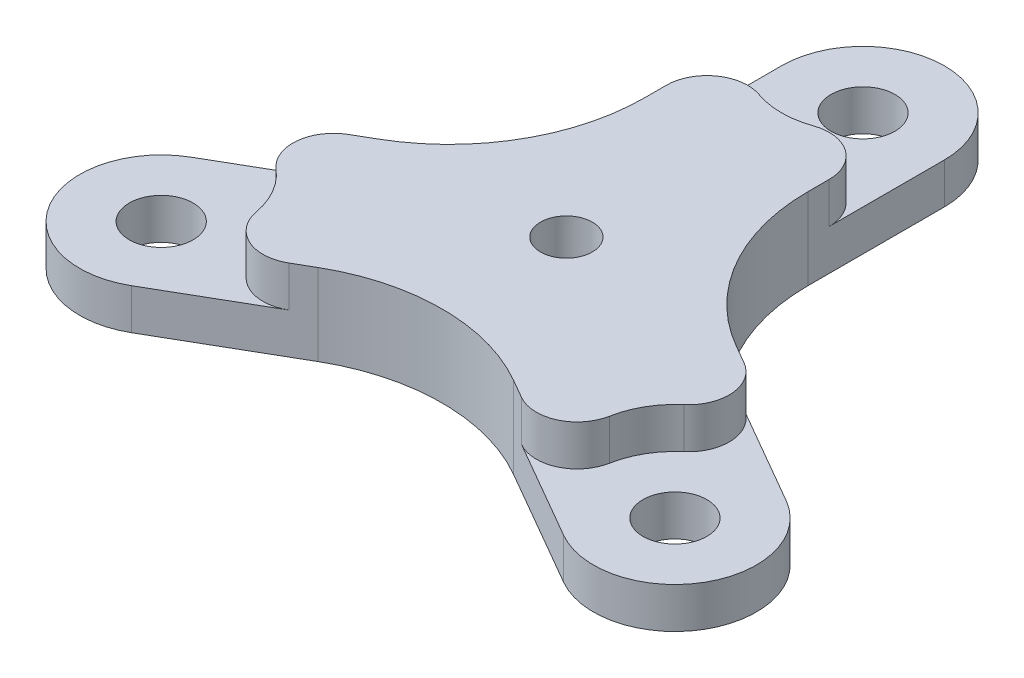
ISO-10303-21;
HEADER;
FILE_DESCRIPTION(('STEP AP214'),'2;1');
FILE_NAME('part.step','',(''),(''),'','','');
FILE_SCHEMA(('AUTOMOTIVE_DESIGN { 1 0 10303 214 1 1 1 1 }'));
ENDSEC;
DATA;
#1=APPLICATION_CONTEXT('core data for automotive mechanical design processes');
#2=APPLICATION_PROTOCOL_DEFINITION('international standard','automotive_design',2000,#1);
#3=PRODUCT_CONTEXT('',#1,'mechanical');
#4=PRODUCT('Part','Part','',(#3));
#5=PRODUCT_RELATED_PRODUCT_CATEGORY('part','',(#4));
#6=PRODUCT_DEFINITION_FORMATION('','',#4);
#7=PRODUCT_DEFINITION_CONTEXT('part definition',#1,'design');
#8=PRODUCT_DEFINITION('design','',#6,#7);
#9=PRODUCT_DEFINITION_SHAPE('','',#8);
#10=(LENGTH_UNIT() NAMED_UNIT(*) SI_UNIT(.MILLI.,.METRE.));
#11=(NAMED_UNIT(*) PLANE_ANGLE_UNIT() SI_UNIT($,.RADIAN.));
#12=(NAMED_UNIT(*) SI_UNIT($,.STERADIAN.) SOLID_ANGLE_UNIT());
#13=UNCERTAINTY_MEASURE_WITH_UNIT(LENGTH_MEASURE(1.E-05),#10,'distance_accuracy_value','');
#14=(GEOMETRIC_REPRESENTATION_CONTEXT(3) GLOBAL_UNCERTAINTY_ASSIGNED_CONTEXT((#13)) GLOBAL_UNIT_ASSIGNED_CONTEXT((#10,
#11,#12)) REPRESENTATION_CONTEXT('',''));
#15=CARTESIAN_POINT('',(0.,0.,0.));
#16=DIRECTION('',(0.,0.,1.));
#17=DIRECTION('',(1.,0.,0.));
#18=AXIS2_PLACEMENT_3D('',#15,#16,#17);
#19=CARTESIAN_POINT('',(20.0173111830735,3.175,11.5570000000001));
#20=DIRECTION('',(0.,-1.,0.));
#21=DIRECTION('',(0.,0.,-1.));
#22=AXIS2_PLACEMENT_3D('',#19,#20,#21);
#23=CYLINDRICAL_SURFACE('',#22,6.35);
#24=CARTESIAN_POINT('',(20.0173111830735,0.,11.5570000000001));
#25=DIRECTION('',(0.,1.,0.));
#26=DIRECTION('',(-0.866025403784436,0.,-0.500000000000004));
#27=AXIS2_PLACEMENT_3D('',#24,#25,#26);
#28=CIRCLE('',#27,6.35);
#29=CARTESIAN_POINT('',(16.8423111830734,0.,17.0562613140313));
#30=VERTEX_POINT('',#29);
#31=CARTESIAN_POINT('',(23.1923111830735,0.,6.05773868596892));
#32=VERTEX_POINT('',#31);
#33=EDGE_CURVE('E494',#30,#32,#28,.T.);
#34=ORIENTED_EDGE('',*,*,#33,.F.);
#35=DIRECTION('',(0.,-1.,0.));
#36=VECTOR('',#35,1.);
#37=CARTESIAN_POINT('',(16.8423111830734,3.175,17.0562613140313));
#38=LINE('',#37,#36);
#39=CARTESIAN_POINT('',(16.8423111830734,-3.175,17.0562613140313));
#40=VERTEX_POINT('',#39);
#41=EDGE_CURVE('E265',#30,#40,#38,.T.);
#42=ORIENTED_EDGE('',*,*,#41,.T.);
#43=CARTESIAN_POINT('',(20.0173111830735,-3.175,11.5570000000001));
#44=DIRECTION('',(0.,1.,0.));
#45=DIRECTION('',(-0.866025403784436,0.,-0.500000000000004));
#46=AXIS2_PLACEMENT_3D('',#43,#44,#45);
#47=CIRCLE('',#46,6.35);
#48=CARTESIAN_POINT('',(23.1923111830735,-3.175,6.05773868596892));
#49=VERTEX_POINT('',#48);
#50=EDGE_CURVE('E256',#40,#49,#47,.T.);
#51=ORIENTED_EDGE('',*,*,#50,.T.);
#52=DIRECTION('',(0.,-1.,0.));
#53=VECTOR('',#52,1.);
#54=CARTESIAN_POINT('',(23.1923111830735,3.175,6.05773868596892));
#55=LINE('',#54,#53);
#56=EDGE_CURVE('E253',#32,#49,#55,.T.);
#57=ORIENTED_EDGE('',*,*,#56,.F.);
#58=EDGE_LOOP('',(#34,#42,#51,#57));
#59=FACE_BOUND('',#58,.T.);
#60=ADVANCED_FACE('F39',(#59),#23,.T.);
#61=CARTESIAN_POINT('',(20.0173111830735,3.175,11.5570000000001));
#62=DIRECTION('',(0.,-1.,0.));
#63=DIRECTION('',(0.,0.,-1.));
#64=AXIS2_PLACEMENT_3D('',#61,#62,#63);
#65=CYLINDRICAL_SURFACE('',#64,2.4892);
#66=CARTESIAN_POINT('',(20.0173111830735,-3.175,11.5570000000001));
#67=DIRECTION('',(0.,1.,0.));
#68=DIRECTION('',(-0.866025403784436,0.,-0.500000000000004));
#69=AXIS2_PLACEMENT_3D('',#66,#67,#68);
#70=CIRCLE('',#69,2.4892);
#71=CARTESIAN_POINT('',(17.8616007479732,-3.175,10.3124000000001));
#72=VERTEX_POINT('',#71);
#73=EDGE_CURVE('E233',#72,#72,#70,.T.);
#74=ORIENTED_EDGE('',*,*,#73,.F.);
#75=EDGE_LOOP('',(#74));
#76=FACE_BOUND('',#75,.T.);
#77=CARTESIAN_POINT('',(20.0173111830735,0.,11.5570000000001));
#78=DIRECTION('',(0.,1.,0.));
#79=DIRECTION('',(-0.866025403784436,0.,-0.500000000000004));
#80=AXIS2_PLACEMENT_3D('',#77,#78,#79);
#81=CIRCLE('',#80,2.4892);
#82=CARTESIAN_POINT('',(17.8616007479732,0.,10.3124000000001));
#83=VERTEX_POINT('',#82);
#84=EDGE_CURVE('E220',#83,#83,#81,.T.);
#85=ORIENTED_EDGE('',*,*,#84,.T.);
#86=EDGE_LOOP('',(#85));
#87=FACE_BOUND('',#86,.T.);
#88=ADVANCED_FACE('F534',(#76,#87),#65,.F.);
#89=CARTESIAN_POINT('',(-20.0173111830736,3.175,11.5569999999998));
#90=DIRECTION('',(0.,-1.,0.));
#91=DIRECTION('',(0.,0.,-1.));
#92=AXIS2_PLACEMENT_3D('',#89,#90,#91);
#93=CYLINDRICAL_SURFACE('',#92,6.35);
#94=CARTESIAN_POINT('',(-20.0173111830736,0.,11.5569999999998));
#95=DIRECTION('',(0.,1.,0.));
#96=DIRECTION('',(0.866025403784443,0.,-0.499999999999992));
#97=AXIS2_PLACEMENT_3D('',#94,#95,#96);
#98=CIRCLE('',#97,6.35);
#99=CARTESIAN_POINT('',(-23.1923111830736,0.,6.0577386859686));
#100=VERTEX_POINT('',#99);
#101=CARTESIAN_POINT('',(-16.8423111830737,0.,17.056261314031));
#102=VERTEX_POINT('',#101);
#103=EDGE_CURVE('E215',#100,#102,#98,.T.);
#104=ORIENTED_EDGE('',*,*,#103,.F.);
#105=DIRECTION('',(0.,-1.,0.));
#106=VECTOR('',#105,1.);
#107=CARTESIAN_POINT('',(-23.1923111830736,3.175,6.0577386859686));
#108=LINE('',#107,#106);
#109=CARTESIAN_POINT('',(-23.1923111830736,-3.175,6.0577386859686));
#110=VERTEX_POINT('',#109);
#111=EDGE_CURVE('E228',#100,#110,#108,.T.);
#112=ORIENTED_EDGE('',*,*,#111,.T.);
#113=CARTESIAN_POINT('',(-20.0173111830736,-3.175,11.5569999999998));
#114=DIRECTION('',(0.,1.,0.));
#115=DIRECTION('',(0.866025403784443,0.,-0.499999999999992));
#116=AXIS2_PLACEMENT_3D('',#113,#114,#115);
#117=CIRCLE('',#116,6.35);
#118=CARTESIAN_POINT('',(-16.8423111830737,-3.175,17.056261314031));
#119=VERTEX_POINT('',#118);
#120=EDGE_CURVE('E225',#110,#119,#117,.T.);
#121=ORIENTED_EDGE('',*,*,#120,.T.);
#122=DIRECTION('',(0.,-1.,0.));
#123=VECTOR('',#122,1.);
#124=CARTESIAN_POINT('',(-16.8423111830737,3.175,17.056261314031));
#125=LINE('',#124,#123);
#126=EDGE_CURVE('E207',#102,#119,#125,.T.);
#127=ORIENTED_EDGE('',*,*,#126,.F.);
#128=EDGE_LOOP('',(#104,#112,#121,#127));
#129=FACE_BOUND('',#128,.T.);
#130=ADVANCED_FACE('F223',(#129),#93,.T.);
#131=CARTESIAN_POINT('',(-20.0173111830736,3.175,11.5569999999998));
#132=DIRECTION('',(0.,-1.,0.));
#133=DIRECTION('',(0.,0.,-1.));
#134=AXIS2_PLACEMENT_3D('',#131,#132,#133);
#135=CYLINDRICAL_SURFACE('',#134,2.4892);
#136=CARTESIAN_POINT('',(-20.0173111830736,-3.175,11.5569999999998));
#137=DIRECTION('',(0.,1.,0.));
#138=DIRECTION('',(0.866025403784443,0.,-0.499999999999992));
#139=AXIS2_PLACEMENT_3D('',#136,#137,#138);
#140=CIRCLE('',#139,2.4892);
#141=CARTESIAN_POINT('',(-17.8616007479734,-3.175,10.3123999999998));
#142=VERTEX_POINT('',#141);
#143=EDGE_CURVE('E485',#142,#142,#140,.T.);
#144=ORIENTED_EDGE('',*,*,#143,.F.);
#145=EDGE_LOOP('',(#144));
#146=FACE_BOUND('',#145,.T.);
#147=CARTESIAN_POINT('',(-20.0173111830736,0.,11.5569999999998));
#148=DIRECTION('',(0.,1.,0.));
#149=DIRECTION('',(0.866025403784443,0.,-0.499999999999992));
#150=AXIS2_PLACEMENT_3D('',#147,#148,#149);
#151=CIRCLE('',#150,2.4892);
#152=CARTESIAN_POINT('',(-17.8616007479734,0.,10.3123999999998));
#153=VERTEX_POINT('',#152);
#154=EDGE_CURVE('E513',#153,#153,#151,.T.);
#155=ORIENTED_EDGE('',*,*,#154,.T.);
#156=EDGE_LOOP('',(#155));
#157=FACE_BOUND('',#156,.T.);
#158=ADVANCED_FACE('F518',(#146,#157),#135,.F.);
#159=CARTESIAN_POINT('',(6.35,3.175,0.));
#160=DIRECTION('',(-1.,0.,0.));
#161=DIRECTION('',(0.,0.,1.));
#162=AXIS2_PLACEMENT_3D('',#159,#160,#161);
#163=PLANE('',#162);
#164=DIRECTION('',(0.,-1.,0.));
#165=VECTOR('',#164,1.);
#166=CARTESIAN_POINT('',(6.35,3.175,-23.114));
#167=LINE('',#166,#165);
#168=CARTESIAN_POINT('',(6.35,0.,-23.114));
#169=VERTEX_POINT('',#168);
#170=CARTESIAN_POINT('',(6.35,-3.175,-23.114));
#171=VERTEX_POINT('',#170);
#172=EDGE_CURVE('E314',#169,#171,#167,.T.);
#173=ORIENTED_EDGE('',*,*,#172,.F.);
#174=DIRECTION('',(0.,0.,1.));
#175=VECTOR('',#174,1.);
#176=CARTESIAN_POINT('',(6.35,0.,-23.114));
#177=LINE('',#176,#175);
#178=CARTESIAN_POINT('',(6.35,0.,-14.1337438789308));
#179=VERTEX_POINT('',#178);
#180=EDGE_CURVE('E55',#169,#179,#177,.T.);
#181=ORIENTED_EDGE('',*,*,#180,.T.);
#182=DIRECTION('',(0.,1.,0.));
#183=VECTOR('',#182,1.);
#184=CARTESIAN_POINT('',(6.35,3.175,-14.1337438789308));
#185=LINE('',#184,#183);
#186=CARTESIAN_POINT('',(6.35,3.175,-14.1337438789308));
#187=VERTEX_POINT('',#186);
#188=EDGE_CURVE('E417',#179,#187,#185,.T.);
#189=ORIENTED_EDGE('',*,*,#188,.T.);
#190=DIRECTION('',(0.,0.,-1.));
#191=VECTOR('',#190,1.);
#192=CARTESIAN_POINT('',(6.35,3.175,0.));
#193=LINE('',#192,#191);
#194=CARTESIAN_POINT('',(6.35,3.175,-12.464992311804));
#195=VERTEX_POINT('',#194);
#196=EDGE_CURVE('E294',#195,#187,#193,.T.);
#197=ORIENTED_EDGE('',*,*,#196,.F.);
#198=DIRECTION('',(0.,1.,0.));
#199=VECTOR('',#198,1.);
#200=CARTESIAN_POINT('',(6.35,-3.175,-12.464992311804));
#201=LINE('',#200,#199);
#202=CARTESIAN_POINT('',(6.35,-3.175,-12.464992311804));
#203=VERTEX_POINT('',#202);
#204=EDGE_CURVE('E322',#195,#203,#201,.F.);
#205=ORIENTED_EDGE('',*,*,#204,.T.);
#206=DIRECTION('',(0.,0.,-1.));
#207=VECTOR('',#206,1.);
#208=CARTESIAN_POINT('',(6.35,-3.175,0.));
#209=LINE('',#208,#207);
#210=EDGE_CURVE('E290',#203,#171,#209,.T.);
#211=ORIENTED_EDGE('',*,*,#210,.T.);
#212=EDGE_LOOP('',(#173,#181,#189,#197,#205,#211));
#213=FACE_BOUND('',#212,.T.);
#214=ADVANCED_FACE('F448',(#213),#163,.F.);
#215=CARTESIAN_POINT('',(-6.35,3.175,0.));
#216=DIRECTION('',(1.,0.,0.));
#217=DIRECTION('',(0.,0.,-1.));
#218=AXIS2_PLACEMENT_3D('',#215,#216,#217);
#219=PLANE('',#218);
#220=DIRECTION('',(0.,0.,1.));
#221=VECTOR('',#220,1.);
#222=CARTESIAN_POINT('',(-6.35,3.175,0.));
#223=LINE('',#222,#221);
#224=CARTESIAN_POINT('',(-6.35,3.175,-14.1337438789308));
#225=VERTEX_POINT('',#224);
#226=CARTESIAN_POINT('',(-6.35,3.175,-12.4649923118042));
#227=VERTEX_POINT('',#226);
#228=EDGE_CURVE('E298',#225,#227,#223,.T.);
#229=ORIENTED_EDGE('',*,*,#228,.F.);
#230=DIRECTION('',(0.,1.,0.));
#231=VECTOR('',#230,1.);
#232=CARTESIAN_POINT('',(-6.35,3.175,-14.1337438789308));
#233=LINE('',#232,#231);
#234=CARTESIAN_POINT('',(-6.35,0.,-14.1337438789308));
#235=VERTEX_POINT('',#234);
#236=EDGE_CURVE('E425',#225,#235,#233,.F.);
#237=ORIENTED_EDGE('',*,*,#236,.T.);
#238=DIRECTION('',(0.,0.,-1.));
#239=VECTOR('',#238,1.);
#240=CARTESIAN_POINT('',(-6.35,0.,-23.114));
#241=LINE('',#240,#239);
#242=CARTESIAN_POINT('',(-6.35,0.,-23.114));
#243=VERTEX_POINT('',#242);
#244=EDGE_CURVE('E422',#235,#243,#241,.T.);
#245=ORIENTED_EDGE('',*,*,#244,.T.);
#246=DIRECTION('',(0.,-1.,0.));
#247=VECTOR('',#246,1.);
#248=CARTESIAN_POINT('',(-6.35,3.175,-23.114));
#249=LINE('',#248,#247);
#250=CARTESIAN_POINT('',(-6.35,-3.175,-23.114));
#251=VERTEX_POINT('',#250);
#252=EDGE_CURVE('E302',#243,#251,#249,.T.);
#253=ORIENTED_EDGE('',*,*,#252,.T.);
#254=DIRECTION('',(0.,0.,1.));
#255=VECTOR('',#254,1.);
#256=CARTESIAN_POINT('',(-6.35,-3.175,0.));
#257=LINE('',#256,#255);
#258=CARTESIAN_POINT('',(-6.35,-3.175,-12.4649923118042));
#259=VERTEX_POINT('',#258);
#260=EDGE_CURVE('E299',#251,#259,#257,.T.);
#261=ORIENTED_EDGE('',*,*,#260,.T.);
#262=DIRECTION('',(0.,-1.,0.));
#263=VECTOR('',#262,1.);
#264=CARTESIAN_POINT('',(-6.35,3.175,-12.4649923118042));
#265=LINE('',#264,#263);
#266=EDGE_CURVE('E329',#259,#227,#265,.F.);
#267=ORIENTED_EDGE('',*,*,#266,.T.);
#268=EDGE_LOOP('',(#229,#237,#245,#253,#261,#267));
#269=FACE_BOUND('',#268,.T.);
#270=ADVANCED_FACE('F467',(#269),#219,.F.);
#271=CARTESIAN_POINT('',(0.,3.175,-23.114));
#272=DIRECTION('',(0.,-1.,0.));
#273=DIRECTION('',(0.,0.,-1.));
#274=AXIS2_PLACEMENT_3D('',#271,#272,#273);
#275=CYLINDRICAL_SURFACE('',#274,6.35);
#276=CARTESIAN_POINT('',(0.,0.,-23.114));
#277=DIRECTION('',(0.,1.,0.));
#278=DIRECTION('',(0.,0.,1.));
#279=AXIS2_PLACEMENT_3D('',#276,#277,#278);
#280=CIRCLE('',#279,6.35);
#281=EDGE_CURVE('E274',#169,#243,#280,.T.);
#282=ORIENTED_EDGE('',*,*,#281,.F.);
#283=ORIENTED_EDGE('',*,*,#172,.T.);
#284=CARTESIAN_POINT('',(0.,-3.175,-23.114));
#285=DIRECTION('',(0.,1.,0.));
#286=DIRECTION('',(0.,0.,1.));
#287=AXIS2_PLACEMENT_3D('',#284,#285,#286);
#288=CIRCLE('',#287,6.35);
#289=EDGE_CURVE('E305',#171,#251,#288,.T.);
#290=ORIENTED_EDGE('',*,*,#289,.T.);
#291=ORIENTED_EDGE('',*,*,#252,.F.);
#292=EDGE_LOOP('',(#282,#283,#290,#291));
#293=FACE_BOUND('',#292,.T.);
#294=ADVANCED_FACE('F559',(#293),#275,.T.);
#295=CARTESIAN_POINT('',(0.,3.175,-23.114));
#296=DIRECTION('',(0.,-1.,0.));
#297=DIRECTION('',(0.,0.,-1.));
#298=AXIS2_PLACEMENT_3D('',#295,#296,#297);
#299=CYLINDRICAL_SURFACE('',#298,2.4892);
#300=CARTESIAN_POINT('',(0.,-3.175,-23.114));
#301=DIRECTION('',(0.,1.,0.));
#302=DIRECTION('',(0.,0.,1.));
#303=AXIS2_PLACEMENT_3D('',#300,#301,#302);
#304=CIRCLE('',#303,2.4892);
#305=CARTESIAN_POINT('',(0.,-3.175,-20.6248));
#306=VERTEX_POINT('',#305);
#307=EDGE_CURVE('E277',#306,#306,#304,.T.);
#308=ORIENTED_EDGE('',*,*,#307,.F.);
#309=EDGE_LOOP('',(#308));
#310=FACE_BOUND('',#309,.T.);
#311=CARTESIAN_POINT('',(0.,0.,-23.114));
#312=DIRECTION('',(0.,1.,0.));
#313=DIRECTION('',(0.,0.,1.));
#314=AXIS2_PLACEMENT_3D('',#311,#312,#313);
#315=CIRCLE('',#314,2.4892);
#316=CARTESIAN_POINT('',(0.,0.,-20.6248));
#317=VERTEX_POINT('',#316);
#318=EDGE_CURVE('E269',#317,#317,#315,.T.);
#319=ORIENTED_EDGE('',*,*,#318,.T.);
#320=EDGE_LOOP('',(#319));
#321=FACE_BOUND('',#320,.T.);
#322=ADVANCED_FACE('F556',(#310,#321),#299,.F.);
#323=CARTESIAN_POINT('',(0.,3.175,0.));
#324=DIRECTION('',(0.,1.,0.));
#325=DIRECTION('',(0.,0.,1.));
#326=AXIS2_PLACEMENT_3D('',#323,#324,#325);
#327=PLANE('',#326);
#328=CARTESIAN_POINT('',(20.0173111830735,3.175,11.5570000000001));
#329=DIRECTION('',(0.,1.,0.));
#330=DIRECTION('',(-0.866025403784436,0.,-0.500000000000004));
#331=AXIS2_PLACEMENT_3D('',#328,#329,#330);
#332=CIRCLE('',#331,6.35);
#333=CARTESIAN_POINT('',(15.8908912275158,3.175,6.73049418829996));
#334=VERTEX_POINT('',#333);
#335=CARTESIAN_POINT('',(13.7742245608491,3.175,10.3966683976541));
#336=VERTEX_POINT('',#335);
#337=EDGE_CURVE('E501',#334,#336,#332,.T.);
#338=ORIENTED_EDGE('',*,*,#337,.F.);
#339=CARTESIAN_POINT('',(13.8276812497369,3.175,4.3172412824499));
#340=DIRECTION('',(0.,1.,0.));
#341=DIRECTION('',(0.,0.,1.));
#342=AXIS2_PLACEMENT_3D('',#339,#340,#341);
#343=CIRCLE('',#342,3.175);
#344=CARTESIAN_POINT('',(15.4151812497369,3.175,1.56761062543431));
#345=VERTEX_POINT('',#344);
#346=EDGE_CURVE('E387',#334,#345,#343,.T.);
#347=ORIENTED_EDGE('',*,*,#346,.T.);
#348=DIRECTION('',(-0.866025403784436,0.,-0.500000000000004));
#349=VECTOR('',#348,1.);
#350=CARTESIAN_POINT('',(3.17500000000003,3.175,-5.49926131403117));
#351=LINE('',#350,#349);
#352=CARTESIAN_POINT('',(13.9699999999999,3.175,0.733234841870856));
#353=VERTEX_POINT('',#352);
#354=EDGE_CURVE('E249',#345,#353,#351,.T.);
#355=ORIENTED_EDGE('',*,*,#354,.T.);
#356=CARTESIAN_POINT('',(21.59,3.175,-12.464992311804));
#357=DIRECTION('',(0.,1.,0.));
#358=DIRECTION('',(0.,0.,1.));
#359=AXIS2_PLACEMENT_3D('',#356,#357,#358);
#360=CIRCLE('',#359,15.24);
#361=EDGE_CURVE('E340',#353,#195,#360,.F.);
#362=ORIENTED_EDGE('',*,*,#361,.T.);
#363=ORIENTED_EDGE('',*,*,#196,.T.);
#364=CARTESIAN_POINT('',(3.175,3.175,-14.1337438789308));
#365=DIRECTION('',(0.,1.,0.));
#366=DIRECTION('',(0.,0.,1.));
#367=AXIS2_PLACEMENT_3D('',#364,#365,#366);
#368=CIRCLE('',#367,3.175);
#369=CARTESIAN_POINT('',(2.11666666666667,3.175,-17.1271625859539));
#370=VERTEX_POINT('',#369);
#371=EDGE_CURVE('E375',#187,#370,#368,.T.);
#372=ORIENTED_EDGE('',*,*,#371,.T.);
#373=CARTESIAN_POINT('',(0.,3.175,-23.114));
#374=DIRECTION('',(0.,1.,0.));
#375=DIRECTION('',(0.,0.,1.));
#376=AXIS2_PLACEMENT_3D('',#373,#374,#375);
#377=CIRCLE('',#376,6.35);
#378=CARTESIAN_POINT('',(-2.11666666666667,3.175,-17.1271625859539));
#379=VERTEX_POINT('',#378);
#380=EDGE_CURVE('E273',#379,#370,#377,.T.);
#381=ORIENTED_EDGE('',*,*,#380,.F.);
#382=CARTESIAN_POINT('',(-3.175,3.175,-14.1337438789308));
#383=DIRECTION('',(0.,1.,0.));
#384=DIRECTION('',(0.,0.,1.));
#385=AXIS2_PLACEMENT_3D('',#382,#383,#384);
#386=CIRCLE('',#385,3.175);
#387=EDGE_CURVE('E372',#379,#225,#386,.T.);
#388=ORIENTED_EDGE('',*,*,#387,.T.);
#389=ORIENTED_EDGE('',*,*,#228,.T.);
#390=CARTESIAN_POINT('',(-21.59,3.175,-12.4649923118042));
#391=DIRECTION('',(0.,1.,0.));
#392=DIRECTION('',(0.,0.,1.));
#393=AXIS2_PLACEMENT_3D('',#390,#391,#392);
#394=CIRCLE('',#393,15.24);
#395=CARTESIAN_POINT('',(-13.9700000000001,3.175,0.73323484187076));
#396=VERTEX_POINT('',#395);
#397=EDGE_CURVE('E349',#227,#396,#394,.F.);
#398=ORIENTED_EDGE('',*,*,#397,.T.);
#399=DIRECTION('',(-0.866025403784443,0.,0.499999999999992));
#400=VECTOR('',#399,1.);
#401=CARTESIAN_POINT('',(-3.17499999999995,3.175,-5.49926131403122));
#402=LINE('',#401,#400);
#403=CARTESIAN_POINT('',(-15.4151812497369,3.175,1.56761062543409));
#404=VERTEX_POINT('',#403);
#405=EDGE_CURVE('E235',#396,#404,#402,.T.);
#406=ORIENTED_EDGE('',*,*,#405,.T.);
#407=CARTESIAN_POINT('',(-13.827681249737,3.175,4.3172412824497));
#408=DIRECTION('',(0.,1.,0.));
#409=DIRECTION('',(0.,0.,1.));
#410=AXIS2_PLACEMENT_3D('',#407,#408,#409);
#411=CIRCLE('',#410,3.175);
#412=CARTESIAN_POINT('',(-15.8908912275158,3.175,6.73049418829974));
#413=VERTEX_POINT('',#412);
#414=EDGE_CURVE('E378',#404,#413,#411,.T.);
#415=ORIENTED_EDGE('',*,*,#414,.T.);
#416=CARTESIAN_POINT('',(-20.0173111830736,3.175,11.5569999999998));
#417=DIRECTION('',(0.,1.,0.));
#418=DIRECTION('',(0.866025403784443,0.,-0.499999999999992));
#419=AXIS2_PLACEMENT_3D('',#416,#417,#418);
#420=CIRCLE('',#419,6.35);
#421=CARTESIAN_POINT('',(-13.7742245608492,3.175,10.3966683976539));
#422=VERTEX_POINT('',#421);
#423=EDGE_CURVE('E510',#422,#413,#420,.T.);
#424=ORIENTED_EDGE('',*,*,#423,.F.);
#425=CARTESIAN_POINT('',(-10.652681249737,3.175,9.81650259648091));
#426=DIRECTION('',(0.,1.,0.));
#427=DIRECTION('',(0.,0.,1.));
#428=AXIS2_PLACEMENT_3D('',#425,#426,#427);
#429=CIRCLE('',#428,3.175);
#430=CARTESIAN_POINT('',(-9.06518124973704,3.175,12.5661332534965));
#431=VERTEX_POINT('',#430);
#432=EDGE_CURVE('E381',#422,#431,#429,.T.);
#433=ORIENTED_EDGE('',*,*,#432,.T.);
#434=DIRECTION('',(0.866025403784443,0.,-0.499999999999992));
#435=VECTOR('',#434,1.);
#436=CARTESIAN_POINT('',(3.17499999999995,3.175,5.49926131403122));
#437=LINE('',#436,#435);
#438=CARTESIAN_POINT('',(-7.62000000000005,3.175,11.7317574699331));
#439=VERTEX_POINT('',#438);
#440=EDGE_CURVE('E229',#431,#439,#437,.T.);
#441=ORIENTED_EDGE('',*,*,#440,.T.);
#442=CARTESIAN_POINT('',(-1.75207071073658E-13,3.175,24.929984623608));
#443=DIRECTION('',(0.,1.,0.));
#444=DIRECTION('',(0.,0.,1.));
#445=AXIS2_PLACEMENT_3D('',#442,#443,#444);
#446=CIRCLE('',#445,15.24);
#447=CARTESIAN_POINT('',(7.61999999999989,3.175,11.7317574699332));
#448=VERTEX_POINT('',#447);
#449=EDGE_CURVE('E352',#439,#448,#446,.F.);
#450=ORIENTED_EDGE('',*,*,#449,.T.);
#451=DIRECTION('',(0.866025403784436,0.,0.500000000000004));
#452=VECTOR('',#451,1.);
#453=CARTESIAN_POINT('',(-3.17500000000003,3.175,5.49926131403117));
#454=LINE('',#453,#452);
#455=CARTESIAN_POINT('',(9.06518124973687,3.175,12.5661332534967));
#456=VERTEX_POINT('',#455);
#457=EDGE_CURVE('E245',#448,#456,#454,.T.);
#458=ORIENTED_EDGE('',*,*,#457,.T.);
#459=CARTESIAN_POINT('',(10.6526812497369,3.175,9.81650259648107));
#460=DIRECTION('',(0.,1.,0.));
#461=DIRECTION('',(0.,0.,1.));
#462=AXIS2_PLACEMENT_3D('',#459,#460,#461);
#463=CIRCLE('',#462,3.175);
#464=EDGE_CURVE('E384',#456,#336,#463,.T.);
#465=ORIENTED_EDGE('',*,*,#464,.T.);
#466=EDGE_LOOP('',(#338,#347,#355,#362,#363,#372,#381,#388,#389,#398,#406,#415,#424,#433,#441,
#450,#458,#465));
#467=FACE_BOUND('',#466,.T.);
#468=CARTESIAN_POINT('',(0.,3.175,0.));
#469=DIRECTION('',(0.,1.,0.));
#470=DIRECTION('',(0.,0.,1.));
#471=AXIS2_PLACEMENT_3D('',#468,#469,#470);
#472=CIRCLE('',#471,2.0193);
#473=CARTESIAN_POINT('',(0.,3.175,2.0193));
#474=VERTEX_POINT('',#473);
#475=EDGE_CURVE('E286',#474,#474,#472,.T.);
#476=ORIENTED_EDGE('',*,*,#475,.F.);
#477=EDGE_LOOP('',(#476));
#478=FACE_BOUND('',#477,.T.);
#479=ADVANCED_FACE('F456',(#467,#478),#327,.T.);
#480=CARTESIAN_POINT('',(0.,-3.175,0.));
#481=DIRECTION('',(0.,1.,0.));
#482=DIRECTION('',(0.,0.,1.));
#483=AXIS2_PLACEMENT_3D('',#480,#481,#482);
#484=PLANE('',#483);
#485=ORIENTED_EDGE('',*,*,#210,.F.);
#486=CARTESIAN_POINT('',(21.59,-3.175,-12.464992311804));
#487=DIRECTION('',(0.,1.,0.));
#488=DIRECTION('',(0.,0.,1.));
#489=AXIS2_PLACEMENT_3D('',#486,#487,#488);
#490=CIRCLE('',#489,15.24);
#491=CARTESIAN_POINT('',(13.9699999999999,-3.175,0.733234841870856));
#492=VERTEX_POINT('',#491);
#493=EDGE_CURVE('E343',#203,#492,#490,.T.);
#494=ORIENTED_EDGE('',*,*,#493,.T.);
#495=DIRECTION('',(-0.866025403784436,0.,-0.500000000000004));
#496=VECTOR('',#495,1.);
#497=CARTESIAN_POINT('',(3.17500000000003,-3.175,-5.49926131403117));
#498=LINE('',#497,#496);
#499=EDGE_CURVE('E250',#49,#492,#498,.T.);
#500=ORIENTED_EDGE('',*,*,#499,.F.);
#501=ORIENTED_EDGE('',*,*,#50,.F.);
#502=DIRECTION('',(0.866025403784436,0.,0.500000000000004));
#503=VECTOR('',#502,1.);
#504=CARTESIAN_POINT('',(-3.17500000000003,-3.175,5.49926131403117));
#505=LINE('',#504,#503);
#506=CARTESIAN_POINT('',(7.61999999999989,-3.175,11.7317574699332));
#507=VERTEX_POINT('',#506);
#508=EDGE_CURVE('E244',#507,#40,#505,.T.);
#509=ORIENTED_EDGE('',*,*,#508,.F.);
#510=CARTESIAN_POINT('',(-1.75207071073658E-13,-3.175,24.929984623608));
#511=DIRECTION('',(0.,1.,0.));
#512=DIRECTION('',(0.,0.,1.));
#513=AXIS2_PLACEMENT_3D('',#510,#511,#512);
#514=CIRCLE('',#513,15.24);
#515=CARTESIAN_POINT('',(-7.62000000000005,-3.175,11.7317574699331));
#516=VERTEX_POINT('',#515);
#517=EDGE_CURVE('E355',#507,#516,#514,.T.);
#518=ORIENTED_EDGE('',*,*,#517,.T.);
#519=DIRECTION('',(0.866025403784443,0.,-0.499999999999992));
#520=VECTOR('',#519,1.);
#521=CARTESIAN_POINT('',(3.17499999999995,-3.175,5.49926131403122));
#522=LINE('',#521,#520);
#523=EDGE_CURVE('E238',#119,#516,#522,.T.);
#524=ORIENTED_EDGE('',*,*,#523,.F.);
#525=ORIENTED_EDGE('',*,*,#120,.F.);
#526=DIRECTION('',(-0.866025403784443,0.,0.499999999999992));
#527=VECTOR('',#526,1.);
#528=CARTESIAN_POINT('',(-3.17499999999995,-3.175,-5.49926131403122));
#529=LINE('',#528,#527);
#530=CARTESIAN_POINT('',(-13.9700000000001,-3.175,0.73323484187076));
#531=VERTEX_POINT('',#530);
#532=EDGE_CURVE('E488',#531,#110,#529,.T.);
#533=ORIENTED_EDGE('',*,*,#532,.F.);
#534=CARTESIAN_POINT('',(-21.59,-3.175,-12.4649923118042));
#535=DIRECTION('',(0.,1.,0.));
#536=DIRECTION('',(0.,0.,1.));
#537=AXIS2_PLACEMENT_3D('',#534,#535,#536);
#538=CIRCLE('',#537,15.24);
#539=EDGE_CURVE('E346',#531,#259,#538,.T.);
#540=ORIENTED_EDGE('',*,*,#539,.T.);
#541=ORIENTED_EDGE('',*,*,#260,.F.);
#542=ORIENTED_EDGE('',*,*,#289,.F.);
#543=EDGE_LOOP('',(#485,#494,#500,#501,#509,#518,#524,#525,#533,#540,#541,#542));
#544=FACE_BOUND('',#543,.T.);
#545=CARTESIAN_POINT('',(0.,-3.175,0.));
#546=DIRECTION('',(0.,1.,0.));
#547=DIRECTION('',(0.,0.,1.));
#548=AXIS2_PLACEMENT_3D('',#545,#546,#547);
#549=CIRCLE('',#548,2.0193);
#550=CARTESIAN_POINT('',(0.,-3.175,2.0193));
#551=VERTEX_POINT('',#550);
#552=EDGE_CURVE('E285',#551,#551,#549,.T.);
#553=ORIENTED_EDGE('',*,*,#552,.T.);
#554=EDGE_LOOP('',(#553));
#555=FACE_BOUND('',#554,.T.);
#556=ORIENTED_EDGE('',*,*,#73,.T.);
#557=EDGE_LOOP('',(#556));
#558=FACE_BOUND('',#557,.T.);
#559=ORIENTED_EDGE('',*,*,#143,.T.);
#560=EDGE_LOOP('',(#559));
#561=FACE_BOUND('',#560,.T.);
#562=ORIENTED_EDGE('',*,*,#307,.T.);
#563=EDGE_LOOP('',(#562));
#564=FACE_BOUND('',#563,.T.);
#565=ADVANCED_FACE('F563',(#544,#555,#558,#561,#564),#484,.F.);
#566=CARTESIAN_POINT('',(0.,3.175,0.));
#567=DIRECTION('',(0.,-1.,0.));
#568=DIRECTION('',(0.,0.,-1.));
#569=AXIS2_PLACEMENT_3D('',#566,#567,#568);
#570=CYLINDRICAL_SURFACE('',#569,2.0193);
#571=ORIENTED_EDGE('',*,*,#475,.T.);
#572=EDGE_LOOP('',(#571));
#573=FACE_BOUND('',#572,.T.);
#574=ORIENTED_EDGE('',*,*,#552,.F.);
#575=EDGE_LOOP('',(#574));
#576=FACE_BOUND('',#575,.T.);
#577=ADVANCED_FACE('F555',(#573,#576),#570,.F.);
#578=CARTESIAN_POINT('',(0.,0.,-23.114));
#579=DIRECTION('',(0.,1.,0.));
#580=DIRECTION('',(0.,0.,1.));
#581=AXIS2_PLACEMENT_3D('',#578,#579,#580);
#582=CYLINDRICAL_SURFACE('',#581,6.35);
#583=ORIENTED_EDGE('',*,*,#380,.T.);
#584=DIRECTION('',(0.,1.,0.));
#585=VECTOR('',#584,1.);
#586=CARTESIAN_POINT('',(2.11666666666667,0.,-17.1271625859539));
#587=LINE('',#586,#585);
#588=CARTESIAN_POINT('',(2.11666666666667,0.,-17.1271625859539));
#589=VERTEX_POINT('',#588);
#590=EDGE_CURVE('E413',#370,#589,#587,.F.);
#591=ORIENTED_EDGE('',*,*,#590,.T.);
#592=CARTESIAN_POINT('',(-2.11666666666667,0.,-17.1271625859539));
#593=VERTEX_POINT('',#592);
#594=EDGE_CURVE('E278',#593,#589,#280,.T.);
#595=ORIENTED_EDGE('',*,*,#594,.F.);
#596=DIRECTION('',(0.,1.,0.));
#597=VECTOR('',#596,1.);
#598=CARTESIAN_POINT('',(-2.11666666666667,0.,-17.1271625859539));
#599=LINE('',#598,#597);
#600=EDGE_CURVE('E410',#593,#379,#599,.T.);
#601=ORIENTED_EDGE('',*,*,#600,.T.);
#602=EDGE_LOOP('',(#583,#591,#595,#601));
#603=FACE_BOUND('',#602,.T.);
#604=ADVANCED_FACE('F460',(#603),#582,.F.);
#605=CARTESIAN_POINT('',(0.,0.,-23.114));
#606=DIRECTION('',(0.,1.,0.));
#607=DIRECTION('',(0.,0.,1.));
#608=AXIS2_PLACEMENT_3D('',#605,#606,#607);
#609=PLANE('',#608);
#610=ORIENTED_EDGE('',*,*,#318,.F.);
#611=EDGE_LOOP('',(#610));
#612=FACE_BOUND('',#611,.T.);
#613=ORIENTED_EDGE('',*,*,#281,.T.);
#614=ORIENTED_EDGE('',*,*,#244,.F.);
#615=CARTESIAN_POINT('',(-3.175,0.,-14.1337438789308));
#616=DIRECTION('',(0.,1.,0.));
#617=DIRECTION('',(0.,0.,1.));
#618=AXIS2_PLACEMENT_3D('',#615,#616,#617);
#619=CIRCLE('',#618,3.175);
#620=EDGE_CURVE('E11',#235,#593,#619,.F.);
#621=ORIENTED_EDGE('',*,*,#620,.T.);
#622=ORIENTED_EDGE('',*,*,#594,.T.);
#623=CARTESIAN_POINT('',(3.175,0.,-14.1337438789308));
#624=DIRECTION('',(0.,1.,0.));
#625=DIRECTION('',(0.,0.,1.));
#626=AXIS2_PLACEMENT_3D('',#623,#624,#625);
#627=CIRCLE('',#626,3.175);
#628=EDGE_CURVE('E48',#589,#179,#627,.F.);
#629=ORIENTED_EDGE('',*,*,#628,.T.);
#630=ORIENTED_EDGE('',*,*,#180,.F.);
#631=EDGE_LOOP('',(#613,#614,#621,#622,#629,#630));
#632=FACE_BOUND('',#631,.T.);
#633=ADVANCED_FACE('F442',(#612,#632),#609,.T.);
#634=CARTESIAN_POINT('',(3.17500000000003,3.175,-5.49926131403117));
#635=DIRECTION('',(-0.500000000000004,0.,0.866025403784436));
#636=DIRECTION('',(0.866025403784436,0.,0.500000000000004));
#637=AXIS2_PLACEMENT_3D('',#634,#635,#636);
#638=PLANE('',#637);
#639=ORIENTED_EDGE('',*,*,#354,.F.);
#640=DIRECTION('',(0.,1.,0.));
#641=VECTOR('',#640,1.);
#642=CARTESIAN_POINT('',(15.4151812497369,3.175,1.56761062543431));
#643=LINE('',#642,#641);
#644=CARTESIAN_POINT('',(15.4151812497369,0.,1.56761062543431));
#645=VERTEX_POINT('',#644);
#646=EDGE_CURVE('E361',#345,#645,#643,.F.);
#647=ORIENTED_EDGE('',*,*,#646,.T.);
#648=DIRECTION('',(0.866025403784436,0.,0.500000000000004));
#649=VECTOR('',#648,1.);
#650=CARTESIAN_POINT('',(23.1923111830735,0.,6.05773868596892));
#651=LINE('',#650,#649);
#652=EDGE_CURVE('E358',#645,#32,#651,.T.);
#653=ORIENTED_EDGE('',*,*,#652,.T.);
#654=ORIENTED_EDGE('',*,*,#56,.T.);
#655=ORIENTED_EDGE('',*,*,#499,.T.);
#656=DIRECTION('',(0.,1.,0.));
#657=VECTOR('',#656,1.);
#658=CARTESIAN_POINT('',(13.9699999999999,3.175,0.733234841870855));
#659=LINE('',#658,#657);
#660=EDGE_CURVE('E318',#492,#353,#659,.T.);
#661=ORIENTED_EDGE('',*,*,#660,.T.);
#662=EDGE_LOOP('',(#639,#647,#653,#654,#655,#661));
#663=FACE_BOUND('',#662,.T.);
#664=ADVANCED_FACE('F545',(#663),#638,.F.);
#665=CARTESIAN_POINT('',(-3.17499999999995,3.175,-5.49926131403122));
#666=DIRECTION('',(0.499999999999992,0.,0.866025403784443));
#667=DIRECTION('',(0.866025403784443,0.,-0.499999999999992));
#668=AXIS2_PLACEMENT_3D('',#665,#666,#667);
#669=PLANE('',#668);
#670=ORIENTED_EDGE('',*,*,#111,.F.);
#671=DIRECTION('',(0.866025403784443,0.,-0.499999999999992));
#672=VECTOR('',#671,1.);
#673=CARTESIAN_POINT('',(-23.1923111830736,0.,6.0577386859686));
#674=LINE('',#673,#672);
#675=CARTESIAN_POINT('',(-15.4151812497369,0.,1.56761062543409));
#676=VERTEX_POINT('',#675);
#677=EDGE_CURVE('E63',#100,#676,#674,.T.);
#678=ORIENTED_EDGE('',*,*,#677,.T.);
#679=DIRECTION('',(0.,1.,0.));
#680=VECTOR('',#679,1.);
#681=CARTESIAN_POINT('',(-15.4151812497369,3.175,1.56761062543409));
#682=LINE('',#681,#680);
#683=EDGE_CURVE('E405',#676,#404,#682,.T.);
#684=ORIENTED_EDGE('',*,*,#683,.T.);
#685=ORIENTED_EDGE('',*,*,#405,.F.);
#686=DIRECTION('',(0.,-1.,0.));
#687=VECTOR('',#686,1.);
#688=CARTESIAN_POINT('',(-13.9700000000001,-3.175,0.73323484187076));
#689=LINE('',#688,#687);
#690=EDGE_CURVE('E325',#396,#531,#689,.T.);
#691=ORIENTED_EDGE('',*,*,#690,.T.);
#692=ORIENTED_EDGE('',*,*,#532,.T.);
#693=EDGE_LOOP('',(#670,#678,#684,#685,#691,#692));
#694=FACE_BOUND('',#693,.T.);
#695=ADVANCED_FACE('F478',(#694),#669,.F.);
#696=CARTESIAN_POINT('',(-3.17500000000003,3.175,5.49926131403117));
#697=DIRECTION('',(0.500000000000004,0.,-0.866025403784436));
#698=DIRECTION('',(-0.866025403784436,0.,-0.500000000000004));
#699=AXIS2_PLACEMENT_3D('',#696,#697,#698);
#700=PLANE('',#699);
#701=ORIENTED_EDGE('',*,*,#41,.F.);
#702=DIRECTION('',(-0.866025403784436,0.,-0.500000000000004));
#703=VECTOR('',#702,1.);
#704=CARTESIAN_POINT('',(16.8423111830734,0.,17.0562613140313));
#705=LINE('',#704,#703);
#706=CARTESIAN_POINT('',(9.06518124973687,0.,12.5661332534967));
#707=VERTEX_POINT('',#706);
#708=EDGE_CURVE('E212',#30,#707,#705,.T.);
#709=ORIENTED_EDGE('',*,*,#708,.T.);
#710=DIRECTION('',(0.,1.,0.));
#711=VECTOR('',#710,1.);
#712=CARTESIAN_POINT('',(9.06518124973687,3.175,12.5661332534967));
#713=LINE('',#712,#711);
#714=EDGE_CURVE('E390',#707,#456,#713,.T.);
#715=ORIENTED_EDGE('',*,*,#714,.T.);
#716=ORIENTED_EDGE('',*,*,#457,.F.);
#717=DIRECTION('',(0.,1.,0.));
#718=VECTOR('',#717,1.);
#719=CARTESIAN_POINT('',(7.61999999999988,-3.175,11.7317574699332));
#720=LINE('',#719,#718);
#721=EDGE_CURVE('E337',#448,#507,#720,.F.);
#722=ORIENTED_EDGE('',*,*,#721,.T.);
#723=ORIENTED_EDGE('',*,*,#508,.T.);
#724=EDGE_LOOP('',(#701,#709,#715,#716,#722,#723));
#725=FACE_BOUND('',#724,.T.);
#726=ADVANCED_FACE('F546',(#725),#700,.F.);
#727=CARTESIAN_POINT('',(3.17499999999995,3.175,5.49926131403122));
#728=DIRECTION('',(-0.499999999999992,0.,-0.866025403784443));
#729=DIRECTION('',(-0.866025403784443,0.,0.499999999999992));
#730=AXIS2_PLACEMENT_3D('',#727,#728,#729);
#731=PLANE('',#730);
#732=ORIENTED_EDGE('',*,*,#440,.F.);
#733=DIRECTION('',(0.,1.,0.));
#734=VECTOR('',#733,1.);
#735=CARTESIAN_POINT('',(-9.06518124973704,3.175,12.5661332534965));
#736=LINE('',#735,#734);
#737=CARTESIAN_POINT('',(-9.06518124973704,0.,12.5661332534965));
#738=VERTEX_POINT('',#737);
#739=EDGE_CURVE('E210',#431,#738,#736,.F.);
#740=ORIENTED_EDGE('',*,*,#739,.T.);
#741=DIRECTION('',(-0.866025403784443,0.,0.499999999999992));
#742=VECTOR('',#741,1.);
#743=CARTESIAN_POINT('',(-16.8423111830737,0.,17.056261314031));
#744=LINE('',#743,#742);
#745=EDGE_CURVE('E202',#738,#102,#744,.T.);
#746=ORIENTED_EDGE('',*,*,#745,.T.);
#747=ORIENTED_EDGE('',*,*,#126,.T.);
#748=ORIENTED_EDGE('',*,*,#523,.T.);
#749=DIRECTION('',(0.,1.,0.));
#750=VECTOR('',#749,1.);
#751=CARTESIAN_POINT('',(-7.62000000000005,3.175,11.7317574699331));
#752=LINE('',#751,#750);
#753=EDGE_CURVE('E333',#516,#439,#752,.T.);
#754=ORIENTED_EDGE('',*,*,#753,.T.);
#755=EDGE_LOOP('',(#732,#740,#746,#747,#748,#754));
#756=FACE_BOUND('',#755,.T.);
#757=ADVANCED_FACE('F204',(#756),#731,.F.);
#758=CARTESIAN_POINT('',(-20.0173111830736,0.,11.5569999999998));
#759=DIRECTION('',(0.,1.,0.));
#760=DIRECTION('',(0.,0.,1.));
#761=AXIS2_PLACEMENT_3D('',#758,#759,#760);
#762=CYLINDRICAL_SURFACE('',#761,6.35);
#763=CARTESIAN_POINT('',(-13.7742245608492,0.,10.3966683976539));
#764=VERTEX_POINT('',#763);
#765=CARTESIAN_POINT('',(-15.8908912275158,0.,6.73049418829974));
#766=VERTEX_POINT('',#765);
#767=EDGE_CURVE('E221',#764,#766,#98,.T.);
#768=ORIENTED_EDGE('',*,*,#767,.F.);
#769=DIRECTION('',(0.,1.,0.));
#770=VECTOR('',#769,1.);
#771=CARTESIAN_POINT('',(-13.7742245608492,0.,10.3966683976539));
#772=LINE('',#771,#770);
#773=EDGE_CURVE('E402',#764,#422,#772,.T.);
#774=ORIENTED_EDGE('',*,*,#773,.T.);
#775=ORIENTED_EDGE('',*,*,#423,.T.);
#776=DIRECTION('',(0.,1.,0.));
#777=VECTOR('',#776,1.);
#778=CARTESIAN_POINT('',(-15.8908912275158,0.,6.73049418829974));
#779=LINE('',#778,#777);
#780=EDGE_CURVE('E398',#413,#766,#779,.F.);
#781=ORIENTED_EDGE('',*,*,#780,.T.);
#782=EDGE_LOOP('',(#768,#774,#775,#781));
#783=FACE_BOUND('',#782,.T.);
#784=ADVANCED_FACE('F522',(#783),#762,.F.);
#785=CARTESIAN_POINT('',(-20.0173111830736,0.,11.5569999999998));
#786=DIRECTION('',(0.,1.,0.));
#787=DIRECTION('',(0.866025403784443,0.,-0.499999999999992));
#788=AXIS2_PLACEMENT_3D('',#785,#786,#787);
#789=PLANE('',#788);
#790=ORIENTED_EDGE('',*,*,#154,.F.);
#791=EDGE_LOOP('',(#790));
#792=FACE_BOUND('',#791,.T.);
#793=ORIENTED_EDGE('',*,*,#103,.T.);
#794=ORIENTED_EDGE('',*,*,#745,.F.);
#795=CARTESIAN_POINT('',(-10.652681249737,0.,9.81650259648091));
#796=DIRECTION('',(0.,1.,0.));
#797=DIRECTION('',(0.,0.,1.));
#798=AXIS2_PLACEMENT_3D('',#795,#796,#797);
#799=CIRCLE('',#798,3.175);
#800=EDGE_CURVE('E435',#738,#764,#799,.F.);
#801=ORIENTED_EDGE('',*,*,#800,.T.);
#802=ORIENTED_EDGE('',*,*,#767,.T.);
#803=CARTESIAN_POINT('',(-13.827681249737,0.,4.3172412824497));
#804=DIRECTION('',(0.,1.,0.));
#805=DIRECTION('',(0.,0.,1.));
#806=AXIS2_PLACEMENT_3D('',#803,#804,#805);
#807=CIRCLE('',#806,3.175);
#808=EDGE_CURVE('E438',#766,#676,#807,.F.);
#809=ORIENTED_EDGE('',*,*,#808,.T.);
#810=ORIENTED_EDGE('',*,*,#677,.F.);
#811=EDGE_LOOP('',(#793,#794,#801,#802,#809,#810));
#812=FACE_BOUND('',#811,.T.);
#813=ADVANCED_FACE('F216',(#792,#812),#789,.T.);
#814=CARTESIAN_POINT('',(20.0173111830735,0.,11.5570000000001));
#815=DIRECTION('',(0.,1.,0.));
#816=DIRECTION('',(0.,0.,1.));
#817=AXIS2_PLACEMENT_3D('',#814,#815,#816);
#818=CYLINDRICAL_SURFACE('',#817,6.35);
#819=CARTESIAN_POINT('',(15.8908912275158,0.,6.73049418829996));
#820=VERTEX_POINT('',#819);
#821=CARTESIAN_POINT('',(13.7742245608491,0.,10.3966683976541));
#822=VERTEX_POINT('',#821);
#823=EDGE_CURVE('E497',#820,#822,#28,.T.);
#824=ORIENTED_EDGE('',*,*,#823,.F.);
#825=DIRECTION('',(0.,1.,0.));
#826=VECTOR('',#825,1.);
#827=CARTESIAN_POINT('',(15.8908912275158,0.,6.73049418829996));
#828=LINE('',#827,#826);
#829=EDGE_CURVE('E369',#820,#334,#828,.T.);
#830=ORIENTED_EDGE('',*,*,#829,.T.);
#831=ORIENTED_EDGE('',*,*,#337,.T.);
#832=DIRECTION('',(0.,1.,0.));
#833=VECTOR('',#832,1.);
#834=CARTESIAN_POINT('',(13.7742245608491,0.,10.3966683976541));
#835=LINE('',#834,#833);
#836=EDGE_CURVE('E365',#336,#822,#835,.F.);
#837=ORIENTED_EDGE('',*,*,#836,.T.);
#838=EDGE_LOOP('',(#824,#830,#831,#837));
#839=FACE_BOUND('',#838,.T.);
#840=ADVANCED_FACE('F521',(#839),#818,.F.);
#841=CARTESIAN_POINT('',(20.0173111830735,0.,11.5570000000001));
#842=DIRECTION('',(0.,1.,0.));
#843=DIRECTION('',(-0.866025403784436,0.,-0.500000000000004));
#844=AXIS2_PLACEMENT_3D('',#841,#842,#843);
#845=PLANE('',#844);
#846=ORIENTED_EDGE('',*,*,#84,.F.);
#847=EDGE_LOOP('',(#846));
#848=FACE_BOUND('',#847,.T.);
#849=ORIENTED_EDGE('',*,*,#33,.T.);
#850=ORIENTED_EDGE('',*,*,#652,.F.);
#851=CARTESIAN_POINT('',(13.8276812497369,0.,4.3172412824499));
#852=DIRECTION('',(0.,1.,0.));
#853=DIRECTION('',(0.,0.,1.));
#854=AXIS2_PLACEMENT_3D('',#851,#852,#853);
#855=CIRCLE('',#854,3.175);
#856=EDGE_CURVE('E429',#645,#820,#855,.F.);
#857=ORIENTED_EDGE('',*,*,#856,.T.);
#858=ORIENTED_EDGE('',*,*,#823,.T.);
#859=CARTESIAN_POINT('',(10.6526812497369,0.,9.81650259648107));
#860=DIRECTION('',(0.,1.,0.));
#861=DIRECTION('',(0.,0.,1.));
#862=AXIS2_PLACEMENT_3D('',#859,#860,#861);
#863=CIRCLE('',#862,3.175);
#864=EDGE_CURVE('E432',#822,#707,#863,.F.);
#865=ORIENTED_EDGE('',*,*,#864,.T.);
#866=ORIENTED_EDGE('',*,*,#708,.F.);
#867=EDGE_LOOP('',(#849,#850,#857,#858,#865,#866));
#868=FACE_BOUND('',#867,.T.);
#869=ADVANCED_FACE('F528',(#848,#868),#845,.T.);
#870=CARTESIAN_POINT('',(21.59,3.175,-12.464992311804));
#871=DIRECTION('',(0.,-1.,0.));
#872=DIRECTION('',(0.,0.,-1.));
#873=AXIS2_PLACEMENT_3D('',#870,#871,#872);
#874=CYLINDRICAL_SURFACE('',#873,15.24);
#875=ORIENTED_EDGE('',*,*,#493,.F.);
#876=ORIENTED_EDGE('',*,*,#204,.F.);
#877=ORIENTED_EDGE('',*,*,#361,.F.);
#878=ORIENTED_EDGE('',*,*,#660,.F.);
#879=EDGE_LOOP('',(#875,#876,#877,#878));
#880=FACE_BOUND('',#879,.T.);
#881=ADVANCED_FACE('F577',(#880),#874,.F.);
#882=CARTESIAN_POINT('',(-21.59,3.175,-12.4649923118042));
#883=DIRECTION('',(0.,1.,0.));
#884=DIRECTION('',(0.,0.,1.));
#885=AXIS2_PLACEMENT_3D('',#882,#883,#884);
#886=CYLINDRICAL_SURFACE('',#885,15.24);
#887=ORIENTED_EDGE('',*,*,#397,.F.);
#888=ORIENTED_EDGE('',*,*,#266,.F.);
#889=ORIENTED_EDGE('',*,*,#539,.F.);
#890=ORIENTED_EDGE('',*,*,#690,.F.);
#891=EDGE_LOOP('',(#887,#888,#889,#890));
#892=FACE_BOUND('',#891,.T.);
#893=ADVANCED_FACE('F473',(#892),#886,.F.);
#894=CARTESIAN_POINT('',(-1.75207071073658E-13,3.175,24.929984623608));
#895=DIRECTION('',(0.,-1.,0.));
#896=DIRECTION('',(0.,0.,-1.));
#897=AXIS2_PLACEMENT_3D('',#894,#895,#896);
#898=CYLINDRICAL_SURFACE('',#897,15.24);
#899=ORIENTED_EDGE('',*,*,#517,.F.);
#900=ORIENTED_EDGE('',*,*,#721,.F.);
#901=ORIENTED_EDGE('',*,*,#449,.F.);
#902=ORIENTED_EDGE('',*,*,#753,.F.);
#903=EDGE_LOOP('',(#899,#900,#901,#902));
#904=FACE_BOUND('',#903,.T.);
#905=ADVANCED_FACE('F583',(#904),#898,.F.);
#906=CARTESIAN_POINT('',(13.8276812497369,0.,4.3172412824499));
#907=DIRECTION('',(0.,1.,0.));
#908=DIRECTION('',(0.,0.,1.));
#909=AXIS2_PLACEMENT_3D('',#906,#907,#908);
#910=CYLINDRICAL_SURFACE('',#909,3.175);
#911=ORIENTED_EDGE('',*,*,#346,.F.);
#912=ORIENTED_EDGE('',*,*,#829,.F.);
#913=ORIENTED_EDGE('',*,*,#856,.F.);
#914=ORIENTED_EDGE('',*,*,#646,.F.);
#915=EDGE_LOOP('',(#911,#912,#913,#914));
#916=FACE_BOUND('',#915,.T.);
#917=ADVANCED_FACE('F586',(#916),#910,.T.);
#918=CARTESIAN_POINT('',(10.6526812497369,0.,9.81650259648107));
#919=DIRECTION('',(0.,1.,0.));
#920=DIRECTION('',(0.,0.,1.));
#921=AXIS2_PLACEMENT_3D('',#918,#919,#920);
#922=CYLINDRICAL_SURFACE('',#921,3.175);
#923=ORIENTED_EDGE('',*,*,#464,.F.);
#924=ORIENTED_EDGE('',*,*,#714,.F.);
#925=ORIENTED_EDGE('',*,*,#864,.F.);
#926=ORIENTED_EDGE('',*,*,#836,.F.);
#927=EDGE_LOOP('',(#923,#924,#925,#926));
#928=FACE_BOUND('',#927,.T.);
#929=ADVANCED_FACE('F590',(#928),#922,.T.);
#930=CARTESIAN_POINT('',(-10.652681249737,0.,9.81650259648091));
#931=DIRECTION('',(0.,1.,0.));
#932=DIRECTION('',(0.,0.,1.));
#933=AXIS2_PLACEMENT_3D('',#930,#931,#932);
#934=CYLINDRICAL_SURFACE('',#933,3.175);
#935=ORIENTED_EDGE('',*,*,#432,.F.);
#936=ORIENTED_EDGE('',*,*,#773,.F.);
#937=ORIENTED_EDGE('',*,*,#800,.F.);
#938=ORIENTED_EDGE('',*,*,#739,.F.);
#939=EDGE_LOOP('',(#935,#936,#937,#938));
#940=FACE_BOUND('',#939,.T.);
#941=ADVANCED_FACE('F594',(#940),#934,.T.);
#942=CARTESIAN_POINT('',(-13.827681249737,0.,4.3172412824497));
#943=DIRECTION('',(0.,1.,0.));
#944=DIRECTION('',(0.,0.,1.));
#945=AXIS2_PLACEMENT_3D('',#942,#943,#944);
#946=CYLINDRICAL_SURFACE('',#945,3.175);
#947=ORIENTED_EDGE('',*,*,#414,.F.);
#948=ORIENTED_EDGE('',*,*,#683,.F.);
#949=ORIENTED_EDGE('',*,*,#808,.F.);
#950=ORIENTED_EDGE('',*,*,#780,.F.);
#951=EDGE_LOOP('',(#947,#948,#949,#950));
#952=FACE_BOUND('',#951,.T.);
#953=ADVANCED_FACE('F598',(#952),#946,.T.);
#954=CARTESIAN_POINT('',(3.175,0.,-14.1337438789308));
#955=DIRECTION('',(0.,1.,0.));
#956=DIRECTION('',(0.,0.,1.));
#957=AXIS2_PLACEMENT_3D('',#954,#955,#956);
#958=CYLINDRICAL_SURFACE('',#957,3.175);
#959=ORIENTED_EDGE('',*,*,#371,.F.);
#960=ORIENTED_EDGE('',*,*,#188,.F.);
#961=ORIENTED_EDGE('',*,*,#628,.F.);
#962=ORIENTED_EDGE('',*,*,#590,.F.);
#963=EDGE_LOOP('',(#959,#960,#961,#962));
#964=FACE_BOUND('',#963,.T.);
#965=ADVANCED_FACE('F452',(#964),#958,.T.);
#966=CARTESIAN_POINT('',(-3.175,0.,-14.1337438789308));
#967=DIRECTION('',(0.,1.,0.));
#968=DIRECTION('',(0.,0.,1.));
#969=AXIS2_PLACEMENT_3D('',#966,#967,#968);
#970=CYLINDRICAL_SURFACE('',#969,3.175);
#971=ORIENTED_EDGE('',*,*,#387,.F.);
#972=ORIENTED_EDGE('',*,*,#600,.F.);
#973=ORIENTED_EDGE('',*,*,#620,.F.);
#974=ORIENTED_EDGE('',*,*,#236,.F.);
#975=EDGE_LOOP('',(#971,#972,#973,#974));
#976=FACE_BOUND('',#975,.T.);
#977=ADVANCED_FACE('F41',(#976),#970,.T.);
#978=CLOSED_SHELL('',(#60,#88,#130,#158,#214,#270,#294,#322,#479,#565,#577,#604,#633,#664,#695,
#726,#757,#784,#813,#840,#869,#881,#893,#905,#917,#929,#941,#953,#965,#977));
#979=MANIFOLD_SOLID_BREP('B2',#978);
#980=ADVANCED_BREP_SHAPE_REPRESENTATION('',(#18,#979),#14);
#981=SHAPE_DEFINITION_REPRESENTATION(#9,#980);
ENDSEC;
END-ISO-10303-21;
